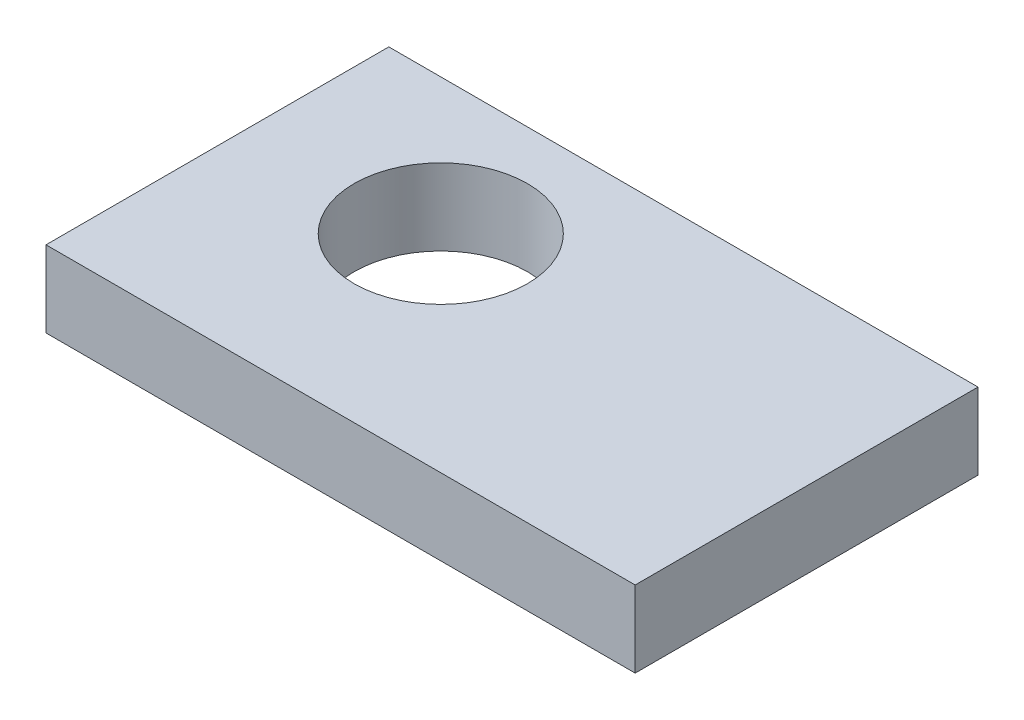
ISO-10303-21;
HEADER;
FILE_DESCRIPTION(('STEP AP214'),'2;1');
FILE_NAME('part.step','',(''),(''),'','','');
FILE_SCHEMA(('AUTOMOTIVE_DESIGN { 1 0 10303 214 1 1 1 1 }'));
ENDSEC;
DATA;
#1=APPLICATION_CONTEXT('core data for automotive mechanical design processes');
#2=APPLICATION_PROTOCOL_DEFINITION('international standard','automotive_design',2000,#1);
#3=PRODUCT_CONTEXT('',#1,'mechanical');
#4=PRODUCT('Part','Part','',(#3));
#5=PRODUCT_RELATED_PRODUCT_CATEGORY('part','',(#4));
#6=PRODUCT_DEFINITION_FORMATION('','',#4);
#7=PRODUCT_DEFINITION_CONTEXT('part definition',#1,'design');
#8=PRODUCT_DEFINITION('design','',#6,#7);
#9=PRODUCT_DEFINITION_SHAPE('','',#8);
#10=(LENGTH_UNIT() NAMED_UNIT(*) SI_UNIT(.MILLI.,.METRE.));
#11=(NAMED_UNIT(*) PLANE_ANGLE_UNIT() SI_UNIT($,.RADIAN.));
#12=(NAMED_UNIT(*) SI_UNIT($,.STERADIAN.) SOLID_ANGLE_UNIT());
#13=UNCERTAINTY_MEASURE_WITH_UNIT(LENGTH_MEASURE(1.E-05),#10,'distance_accuracy_value','');
#14=(GEOMETRIC_REPRESENTATION_CONTEXT(3) GLOBAL_UNCERTAINTY_ASSIGNED_CONTEXT((#13)) GLOBAL_UNIT_ASSIGNED_CONTEXT((#10,
#11,#12)) REPRESENTATION_CONTEXT('',''));
#15=CARTESIAN_POINT('',(0.,0.,0.));
#16=DIRECTION('',(0.,0.,1.));
#17=DIRECTION('',(1.,0.,0.));
#18=AXIS2_PLACEMENT_3D('',#15,#16,#17);
#19=CARTESIAN_POINT('',(-55.2491415796822,10.,-27.5573577222259));
#20=DIRECTION('',(1.,0.,0.));
#21=DIRECTION('',(0.,0.,-1.));
#22=AXIS2_PLACEMENT_3D('',#19,#20,#21);
#23=PLANE('',#22);
#24=DIRECTION('',(0.,0.,1.));
#25=VECTOR('',#24,1.);
#26=CARTESIAN_POINT('',(-55.2491415796822,0.,-27.5573577222259));
#27=LINE('',#26,#25);
#28=CARTESIAN_POINT('',(-55.2491415796822,0.,-27.5573577222259));
#29=VERTEX_POINT('',#28);
#30=CARTESIAN_POINT('',(-55.2491415796822,0.,17.3409714447178));
#31=VERTEX_POINT('',#30);
#32=EDGE_CURVE('E97',#29,#31,#27,.T.);
#33=ORIENTED_EDGE('',*,*,#32,.T.);
#34=DIRECTION('',(0.,-1.,0.));
#35=VECTOR('',#34,1.);
#36=CARTESIAN_POINT('',(-55.2491415796822,10.,17.3409714447178));
#37=LINE('',#36,#35);
#38=CARTESIAN_POINT('',(-55.2491415796822,10.,17.3409714447178));
#39=VERTEX_POINT('',#38);
#40=EDGE_CURVE('E11',#39,#31,#37,.T.);
#41=ORIENTED_EDGE('',*,*,#40,.F.);
#42=DIRECTION('',(0.,0.,1.));
#43=VECTOR('',#42,1.);
#44=CARTESIAN_POINT('',(-55.2491415796822,10.,-27.5573577222259));
#45=LINE('',#44,#43);
#46=CARTESIAN_POINT('',(-55.2491415796822,10.,-27.5573577222259));
#47=VERTEX_POINT('',#46);
#48=EDGE_CURVE('E85',#47,#39,#45,.T.);
#49=ORIENTED_EDGE('',*,*,#48,.F.);
#50=DIRECTION('',(0.,-1.,0.));
#51=VECTOR('',#50,1.);
#52=CARTESIAN_POINT('',(-55.2491415796822,10.,-27.5573577222259));
#53=LINE('',#52,#51);
#54=EDGE_CURVE('E93',#47,#29,#53,.T.);
#55=ORIENTED_EDGE('',*,*,#54,.T.);
#56=EDGE_LOOP('',(#33,#41,#49,#55));
#57=FACE_BOUND('',#56,.T.);
#58=ADVANCED_FACE('F34',(#57),#23,.F.);
#59=CARTESIAN_POINT('',(-55.2491415796822,10.,17.3409714447178));
#60=DIRECTION('',(0.,0.,-1.));
#61=DIRECTION('',(-1.,0.,0.));
#62=AXIS2_PLACEMENT_3D('',#59,#60,#61);
#63=PLANE('',#62);
#64=DIRECTION('',(1.,0.,0.));
#65=VECTOR('',#64,1.);
#66=CARTESIAN_POINT('',(-55.2491415796822,0.,17.3409714447178));
#67=LINE('',#66,#65);
#68=CARTESIAN_POINT('',(21.9114600425504,0.,17.3409714447178));
#69=VERTEX_POINT('',#68);
#70=EDGE_CURVE('E89',#31,#69,#67,.T.);
#71=ORIENTED_EDGE('',*,*,#70,.T.);
#72=DIRECTION('',(0.,-1.,0.));
#73=VECTOR('',#72,1.);
#74=CARTESIAN_POINT('',(21.9114600425504,10.,17.3409714447178));
#75=LINE('',#74,#73);
#76=CARTESIAN_POINT('',(21.9114600425504,10.,17.3409714447178));
#77=VERTEX_POINT('',#76);
#78=EDGE_CURVE('E42',#77,#69,#75,.T.);
#79=ORIENTED_EDGE('',*,*,#78,.F.);
#80=DIRECTION('',(1.,0.,0.));
#81=VECTOR('',#80,1.);
#82=CARTESIAN_POINT('',(-55.2491415796822,10.,17.3409714447178));
#83=LINE('',#82,#81);
#84=EDGE_CURVE('E80',#39,#77,#83,.T.);
#85=ORIENTED_EDGE('',*,*,#84,.F.);
#86=ORIENTED_EDGE('',*,*,#40,.T.);
#87=EDGE_LOOP('',(#71,#79,#85,#86));
#88=FACE_BOUND('',#87,.T.);
#89=ADVANCED_FACE('F88',(#88),#63,.F.);
#90=CARTESIAN_POINT('',(21.9114600425504,10.,-27.5573577222259));
#91=DIRECTION('',(-1.,0.,0.));
#92=DIRECTION('',(0.,0.,1.));
#93=AXIS2_PLACEMENT_3D('',#90,#91,#92);
#94=PLANE('',#93);
#95=DIRECTION('',(0.,0.,-1.));
#96=VECTOR('',#95,1.);
#97=CARTESIAN_POINT('',(21.9114600425504,0.,-27.5573577222259));
#98=LINE('',#97,#96);
#99=CARTESIAN_POINT('',(21.9114600425504,0.,-27.5573577222259));
#100=VERTEX_POINT('',#99);
#101=EDGE_CURVE('E67',#69,#100,#98,.T.);
#102=ORIENTED_EDGE('',*,*,#101,.T.);
#103=DIRECTION('',(0.,-1.,0.));
#104=VECTOR('',#103,1.);
#105=CARTESIAN_POINT('',(21.9114600425504,10.,-27.5573577222259));
#106=LINE('',#105,#104);
#107=CARTESIAN_POINT('',(21.9114600425504,10.,-27.5573577222259));
#108=VERTEX_POINT('',#107);
#109=EDGE_CURVE('E90',#108,#100,#106,.T.);
#110=ORIENTED_EDGE('',*,*,#109,.F.);
#111=DIRECTION('',(0.,0.,-1.));
#112=VECTOR('',#111,1.);
#113=CARTESIAN_POINT('',(21.9114600425504,10.,-27.5573577222259));
#114=LINE('',#113,#112);
#115=EDGE_CURVE('E83',#77,#108,#114,.T.);
#116=ORIENTED_EDGE('',*,*,#115,.F.);
#117=ORIENTED_EDGE('',*,*,#78,.T.);
#118=EDGE_LOOP('',(#102,#110,#116,#117));
#119=FACE_BOUND('',#118,.T.);
#120=ADVANCED_FACE('F91',(#119),#94,.F.);
#121=CARTESIAN_POINT('',(-55.2491415796822,10.,-27.5573577222259));
#122=DIRECTION('',(0.,0.,1.));
#123=DIRECTION('',(1.,0.,0.));
#124=AXIS2_PLACEMENT_3D('',#121,#122,#123);
#125=PLANE('',#124);
#126=DIRECTION('',(-1.,0.,0.));
#127=VECTOR('',#126,1.);
#128=CARTESIAN_POINT('',(-55.2491415796822,0.,-27.5573577222259));
#129=LINE('',#128,#127);
#130=EDGE_CURVE('E73',#100,#29,#129,.T.);
#131=ORIENTED_EDGE('',*,*,#130,.T.);
#132=ORIENTED_EDGE('',*,*,#54,.F.);
#133=DIRECTION('',(-1.,0.,0.));
#134=VECTOR('',#133,1.);
#135=CARTESIAN_POINT('',(-55.2491415796822,10.,-27.5573577222259));
#136=LINE('',#135,#134);
#137=EDGE_CURVE('E50',#108,#47,#136,.T.);
#138=ORIENTED_EDGE('',*,*,#137,.F.);
#139=ORIENTED_EDGE('',*,*,#109,.T.);
#140=EDGE_LOOP('',(#131,#132,#138,#139));
#141=FACE_BOUND('',#140,.T.);
#142=ADVANCED_FACE('F105',(#141),#125,.F.);
#143=CARTESIAN_POINT('',(0.,10.,0.));
#144=DIRECTION('',(0.,1.,0.));
#145=DIRECTION('',(0.,0.,1.));
#146=AXIS2_PLACEMENT_3D('',#143,#144,#145);
#147=PLANE('',#146);
#148=CARTESIAN_POINT('',(-30.6663893329073,10.,-9.77729483449252));
#149=DIRECTION('',(0.,1.,0.));
#150=DIRECTION('',(0.,0.,1.));
#151=AXIS2_PLACEMENT_3D('',#148,#149,#150);
#152=CIRCLE('',#151,11.3536156529269);
#153=CARTESIAN_POINT('',(-30.6663893329073,10.,1.5763208184344));
#154=VERTEX_POINT('',#153);
#155=EDGE_CURVE('E111',#154,#154,#152,.T.);
#156=ORIENTED_EDGE('',*,*,#155,.F.);
#157=EDGE_LOOP('',(#156));
#158=FACE_BOUND('',#157,.T.);
#159=ORIENTED_EDGE('',*,*,#48,.T.);
#160=ORIENTED_EDGE('',*,*,#84,.T.);
#161=ORIENTED_EDGE('',*,*,#115,.T.);
#162=ORIENTED_EDGE('',*,*,#137,.T.);
#163=EDGE_LOOP('',(#159,#160,#161,#162));
#164=FACE_BOUND('',#163,.T.);
#165=ADVANCED_FACE('F81',(#158,#164),#147,.T.);
#166=CARTESIAN_POINT('',(0.,0.,0.));
#167=DIRECTION('',(0.,1.,0.));
#168=DIRECTION('',(0.,0.,1.));
#169=AXIS2_PLACEMENT_3D('',#166,#167,#168);
#170=PLANE('',#169);
#171=CARTESIAN_POINT('',(-30.6663893329073,0.,-9.77729483449252));
#172=DIRECTION('',(0.,1.,0.));
#173=DIRECTION('',(0.,0.,1.));
#174=AXIS2_PLACEMENT_3D('',#171,#172,#173);
#175=CIRCLE('',#174,11.3536156529269);
#176=CARTESIAN_POINT('',(-30.6663893329073,0.,1.5763208184344));
#177=VERTEX_POINT('',#176);
#178=EDGE_CURVE('E100',#177,#177,#175,.T.);
#179=ORIENTED_EDGE('',*,*,#178,.T.);
#180=EDGE_LOOP('',(#179));
#181=FACE_BOUND('',#180,.T.);
#182=ORIENTED_EDGE('',*,*,#32,.F.);
#183=ORIENTED_EDGE('',*,*,#130,.F.);
#184=ORIENTED_EDGE('',*,*,#101,.F.);
#185=ORIENTED_EDGE('',*,*,#70,.F.);
#186=EDGE_LOOP('',(#182,#183,#184,#185));
#187=FACE_BOUND('',#186,.T.);
#188=ADVANCED_FACE('F108',(#181,#187),#170,.F.);
#189=CARTESIAN_POINT('',(-30.6663893329073,0.,-9.77729483449252));
#190=DIRECTION('',(0.,1.,0.));
#191=DIRECTION('',(0.,0.,1.));
#192=AXIS2_PLACEMENT_3D('',#189,#190,#191);
#193=CYLINDRICAL_SURFACE('',#192,11.3536156529269);
#194=ORIENTED_EDGE('',*,*,#178,.F.);
#195=EDGE_LOOP('',(#194));
#196=FACE_BOUND('',#195,.T.);
#197=ORIENTED_EDGE('',*,*,#155,.T.);
#198=EDGE_LOOP('',(#197));
#199=FACE_BOUND('',#198,.T.);
#200=ADVANCED_FACE('F118',(#196,#199),#193,.F.);
#201=CLOSED_SHELL('',(#58,#89,#120,#142,#165,#188,#200));
#202=MANIFOLD_SOLID_BREP('B2',#201);
#203=ADVANCED_BREP_SHAPE_REPRESENTATION('',(#18,#202),#14);
#204=SHAPE_DEFINITION_REPRESENTATION(#9,#203);
ENDSEC;
END-ISO-10303-21;
